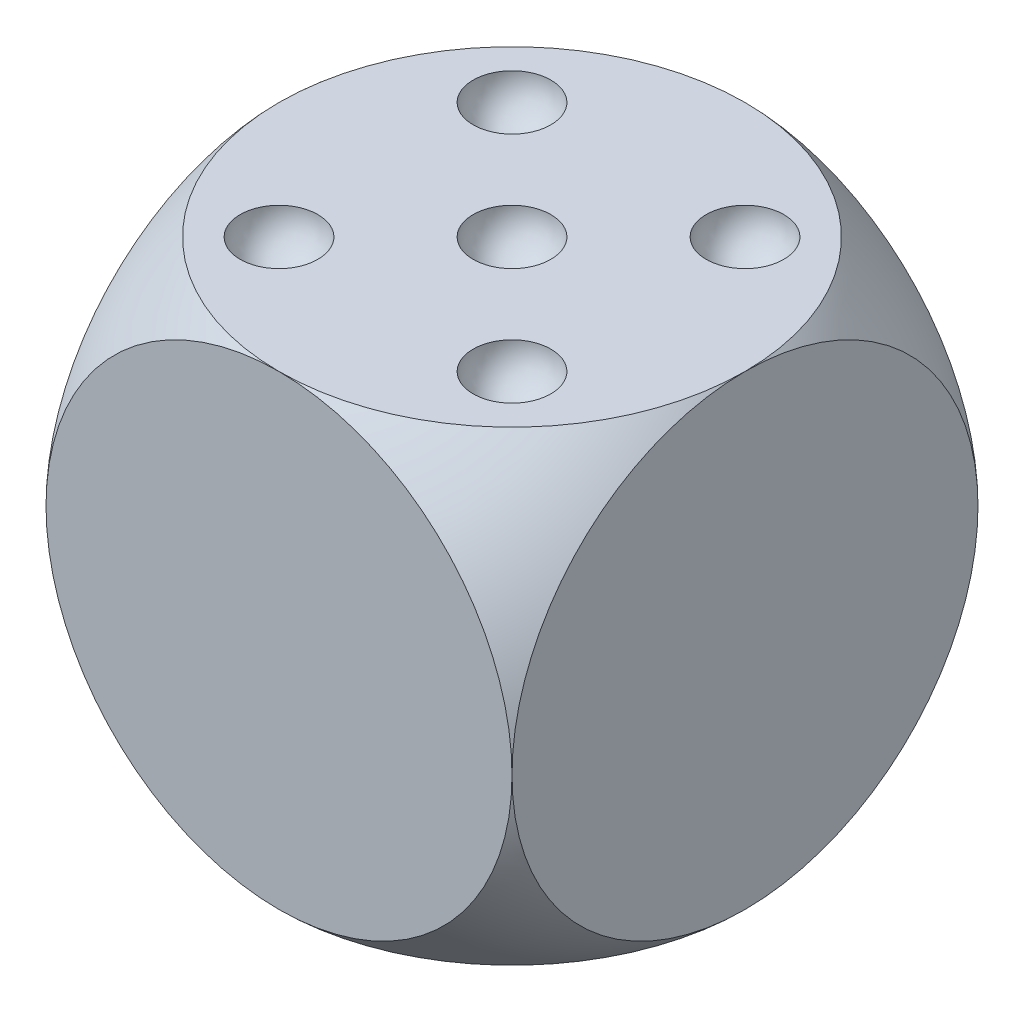
ISO-10303-21;
HEADER;
FILE_DESCRIPTION(('STEP AP214'),'2;1');
FILE_NAME('part.step','',(''),(''),'','','');
FILE_SCHEMA(('AUTOMOTIVE_DESIGN { 1 0 10303 214 1 1 1 1 }'));
ENDSEC;
DATA;
#1=APPLICATION_CONTEXT('core data for automotive mechanical design processes');
#2=APPLICATION_PROTOCOL_DEFINITION('international standard','automotive_design',2000,#1);
#3=PRODUCT_CONTEXT('',#1,'mechanical');
#4=PRODUCT('Part','Part','',(#3));
#5=PRODUCT_RELATED_PRODUCT_CATEGORY('part','',(#4));
#6=PRODUCT_DEFINITION_FORMATION('','',#4);
#7=PRODUCT_DEFINITION_CONTEXT('part definition',#1,'design');
#8=PRODUCT_DEFINITION('design','',#6,#7);
#9=PRODUCT_DEFINITION_SHAPE('','',#8);
#10=(LENGTH_UNIT() NAMED_UNIT(*) SI_UNIT(.MILLI.,.METRE.));
#11=(NAMED_UNIT(*) PLANE_ANGLE_UNIT() SI_UNIT($,.RADIAN.));
#12=(NAMED_UNIT(*) SI_UNIT($,.STERADIAN.) SOLID_ANGLE_UNIT());
#13=UNCERTAINTY_MEASURE_WITH_UNIT(LENGTH_MEASURE(1.E-05),#10,'distance_accuracy_value','');
#14=(GEOMETRIC_REPRESENTATION_CONTEXT(3) GLOBAL_UNCERTAINTY_ASSIGNED_CONTEXT((#13)) GLOBAL_UNIT_ASSIGNED_CONTEXT((#10,
#11,#12)) REPRESENTATION_CONTEXT('',''));
#15=CARTESIAN_POINT('',(0.,0.,0.));
#16=DIRECTION('',(0.,0.,1.));
#17=DIRECTION('',(1.,0.,0.));
#18=AXIS2_PLACEMENT_3D('',#15,#16,#17);
#19=CARTESIAN_POINT('',(0.,0.,30.));
#20=DIRECTION('',(0.,0.,1.));
#21=DIRECTION('',(1.,0.,0.));
#22=AXIS2_PLACEMENT_3D('',#19,#20,#21);
#23=PLANE('',#22);
#24=CARTESIAN_POINT('',(0.,0.,30.));
#25=DIRECTION('',(0.,0.,1.));
#26=DIRECTION('',(1.,0.,0.));
#27=AXIS2_PLACEMENT_3D('',#24,#25,#26);
#28=CIRCLE('',#27,30.);
#29=CARTESIAN_POINT('',(0.,-30.,30.));
#30=VERTEX_POINT('',#29);
#31=CARTESIAN_POINT('',(30.,0.,30.));
#32=VERTEX_POINT('',#31);
#33=EDGE_CURVE('E129',#30,#32,#28,.T.);
#34=ORIENTED_EDGE('',*,*,#33,.T.);
#35=CARTESIAN_POINT('',(0.,30.,30.));
#36=VERTEX_POINT('',#35);
#37=EDGE_CURVE('E74',#32,#36,#28,.T.);
#38=ORIENTED_EDGE('',*,*,#37,.T.);
#39=CARTESIAN_POINT('',(-30.,0.,30.));
#40=VERTEX_POINT('',#39);
#41=EDGE_CURVE('E119',#36,#40,#28,.T.);
#42=ORIENTED_EDGE('',*,*,#41,.T.);
#43=EDGE_CURVE('E125',#40,#30,#28,.T.);
#44=ORIENTED_EDGE('',*,*,#43,.T.);
#45=EDGE_LOOP('',(#34,#38,#42,#44));
#46=FACE_BOUND('',#45,.T.);
#47=ADVANCED_FACE('F48',(#46),#23,.T.);
#48=CARTESIAN_POINT('',(0.,0.,0.));
#49=DIRECTION('',(0.,0.,-1.));
#50=DIRECTION('',(-1.,0.,0.));
#51=AXIS2_PLACEMENT_3D('',#48,#49,#50);
#52=SPHERICAL_SURFACE('',#51,42.4264068711929);
#53=CARTESIAN_POINT('',(0.,-30.,0.));
#54=DIRECTION('',(0.,1.,0.));
#55=DIRECTION('',(0.,0.,1.));
#56=AXIS2_PLACEMENT_3D('',#53,#54,#55);
#57=CIRCLE('',#56,30.);
#58=CARTESIAN_POINT('',(30.,-30.,0.));
#59=VERTEX_POINT('',#58);
#60=EDGE_CURVE('E141',#30,#59,#57,.T.);
#61=ORIENTED_EDGE('',*,*,#60,.T.);
#62=CARTESIAN_POINT('',(30.,0.,0.));
#63=DIRECTION('',(-1.,0.,0.));
#64=DIRECTION('',(0.,-1.,0.));
#65=AXIS2_PLACEMENT_3D('',#62,#63,#64);
#66=CIRCLE('',#65,30.);
#67=EDGE_CURVE('E135',#59,#32,#66,.T.);
#68=ORIENTED_EDGE('',*,*,#67,.T.);
#69=ORIENTED_EDGE('',*,*,#33,.F.);
#70=EDGE_LOOP('',(#61,#68,#69));
#71=FACE_BOUND('',#70,.T.);
#72=ADVANCED_FACE('F190',(#71),#52,.T.);
#73=CARTESIAN_POINT('',(-30.,0.,0.));
#74=DIRECTION('',(1.,0.,0.));
#75=DIRECTION('',(0.,1.,0.));
#76=AXIS2_PLACEMENT_3D('',#73,#74,#75);
#77=CIRCLE('',#76,30.);
#78=CARTESIAN_POINT('',(-30.,-30.,0.));
#79=VERTEX_POINT('',#78);
#80=EDGE_CURVE('E339',#40,#79,#77,.T.);
#81=ORIENTED_EDGE('',*,*,#80,.T.);
#82=EDGE_CURVE('E138',#79,#30,#57,.T.);
#83=ORIENTED_EDGE('',*,*,#82,.T.);
#84=ORIENTED_EDGE('',*,*,#43,.F.);
#85=EDGE_LOOP('',(#81,#83,#84));
#86=FACE_BOUND('',#85,.T.);
#87=ADVANCED_FACE('F195',(#86),#52,.T.);
#88=CARTESIAN_POINT('',(-30.,30.,0.));
#89=VERTEX_POINT('',#88);
#90=EDGE_CURVE('E66',#89,#40,#77,.T.);
#91=ORIENTED_EDGE('',*,*,#90,.T.);
#92=ORIENTED_EDGE('',*,*,#41,.F.);
#93=CARTESIAN_POINT('',(0.,30.,0.));
#94=DIRECTION('',(0.,-1.,0.));
#95=DIRECTION('',(0.,0.,-1.));
#96=AXIS2_PLACEMENT_3D('',#93,#94,#95);
#97=CIRCLE('',#96,30.);
#98=EDGE_CURVE('E114',#36,#89,#97,.T.);
#99=ORIENTED_EDGE('',*,*,#98,.T.);
#100=EDGE_LOOP('',(#91,#92,#99));
#101=FACE_BOUND('',#100,.T.);
#102=ADVANCED_FACE('F120',(#101),#52,.T.);
#103=CARTESIAN_POINT('',(30.,30.,0.));
#104=VERTEX_POINT('',#103);
#105=EDGE_CURVE('E107',#32,#104,#66,.T.);
#106=ORIENTED_EDGE('',*,*,#105,.T.);
#107=EDGE_CURVE('E103',#104,#36,#97,.T.);
#108=ORIENTED_EDGE('',*,*,#107,.T.);
#109=ORIENTED_EDGE('',*,*,#37,.F.);
#110=EDGE_LOOP('',(#106,#108,#109));
#111=FACE_BOUND('',#110,.T.);
#112=ADVANCED_FACE('F105',(#111),#52,.T.);
#113=CARTESIAN_POINT('',(-30.,-30.,30.));
#114=DIRECTION('',(0.,1.,0.));
#115=DIRECTION('',(0.,0.,1.));
#116=AXIS2_PLACEMENT_3D('',#113,#114,#115);
#117=PLANE('',#116);
#118=ORIENTED_EDGE('',*,*,#60,.F.);
#119=ORIENTED_EDGE('',*,*,#82,.F.);
#120=CARTESIAN_POINT('',(0.,-30.,-30.));
#121=VERTEX_POINT('',#120);
#122=EDGE_CURVE('E140',#121,#79,#57,.T.);
#123=ORIENTED_EDGE('',*,*,#122,.F.);
#124=EDGE_CURVE('E348',#59,#121,#57,.T.);
#125=ORIENTED_EDGE('',*,*,#124,.F.);
#126=EDGE_LOOP('',(#118,#119,#123,#125));
#127=FACE_BOUND('',#126,.T.);
#128=ADVANCED_FACE('F200',(#127),#117,.F.);
#129=CARTESIAN_POINT('',(-30.,30.,30.));
#130=DIRECTION('',(1.,0.,0.));
#131=DIRECTION('',(0.,1.,0.));
#132=AXIS2_PLACEMENT_3D('',#129,#130,#131);
#133=PLANE('',#132);
#134=ORIENTED_EDGE('',*,*,#90,.F.);
#135=CARTESIAN_POINT('',(-30.,0.,-30.));
#136=VERTEX_POINT('',#135);
#137=EDGE_CURVE('E142',#136,#89,#77,.T.);
#138=ORIENTED_EDGE('',*,*,#137,.F.);
#139=EDGE_CURVE('E143',#79,#136,#77,.T.);
#140=ORIENTED_EDGE('',*,*,#139,.F.);
#141=ORIENTED_EDGE('',*,*,#80,.F.);
#142=EDGE_LOOP('',(#134,#138,#140,#141));
#143=FACE_BOUND('',#142,.T.);
#144=ADVANCED_FACE('F165',(#143),#133,.F.);
#145=CARTESIAN_POINT('',(-30.,30.,30.));
#146=DIRECTION('',(0.,-1.,0.));
#147=DIRECTION('',(0.,0.,-1.));
#148=AXIS2_PLACEMENT_3D('',#145,#146,#147);
#149=PLANE('',#148);
#150=CARTESIAN_POINT('',(15.,30.,-15.));
#151=DIRECTION('',(0.,-1.,0.));
#152=DIRECTION('',(0.,0.,-1.));
#153=AXIS2_PLACEMENT_3D('',#150,#151,#152);
#154=CIRCLE('',#153,5.);
#155=CARTESIAN_POINT('',(15.,30.,-20.));
#156=VERTEX_POINT('',#155);
#157=EDGE_CURVE('E52',#156,#156,#154,.F.);
#158=ORIENTED_EDGE('',*,*,#157,.F.);
#159=EDGE_LOOP('',(#158));
#160=FACE_BOUND('',#159,.T.);
#161=CARTESIAN_POINT('',(-15.,30.,-15.));
#162=DIRECTION('',(0.,-1.,0.));
#163=DIRECTION('',(0.,0.,-1.));
#164=AXIS2_PLACEMENT_3D('',#161,#162,#163);
#165=CIRCLE('',#164,5.);
#166=CARTESIAN_POINT('',(-15.,30.,-20.));
#167=VERTEX_POINT('',#166);
#168=EDGE_CURVE('E154',#167,#167,#165,.F.);
#169=ORIENTED_EDGE('',*,*,#168,.F.);
#170=EDGE_LOOP('',(#169));
#171=FACE_BOUND('',#170,.T.);
#172=CARTESIAN_POINT('',(0.,30.,0.));
#173=DIRECTION('',(0.,-1.,0.));
#174=DIRECTION('',(0.,0.,-1.));
#175=AXIS2_PLACEMENT_3D('',#172,#173,#174);
#176=CIRCLE('',#175,5.);
#177=CARTESIAN_POINT('',(0.,30.,-5.));
#178=VERTEX_POINT('',#177);
#179=EDGE_CURVE('E152',#178,#178,#176,.F.);
#180=ORIENTED_EDGE('',*,*,#179,.F.);
#181=EDGE_LOOP('',(#180));
#182=FACE_BOUND('',#181,.T.);
#183=CARTESIAN_POINT('',(15.,30.,15.));
#184=DIRECTION('',(0.,-1.,0.));
#185=DIRECTION('',(0.,0.,-1.));
#186=AXIS2_PLACEMENT_3D('',#183,#184,#185);
#187=CIRCLE('',#186,5.);
#188=CARTESIAN_POINT('',(15.,30.,10.));
#189=VERTEX_POINT('',#188);
#190=EDGE_CURVE('E149',#189,#189,#187,.F.);
#191=ORIENTED_EDGE('',*,*,#190,.F.);
#192=EDGE_LOOP('',(#191));
#193=FACE_BOUND('',#192,.T.);
#194=CARTESIAN_POINT('',(-15.,30.,15.));
#195=DIRECTION('',(0.,-1.,0.));
#196=DIRECTION('',(0.,0.,-1.));
#197=AXIS2_PLACEMENT_3D('',#194,#195,#196);
#198=CIRCLE('',#197,5.);
#199=CARTESIAN_POINT('',(-15.,30.,10.));
#200=VERTEX_POINT('',#199);
#201=EDGE_CURVE('E132',#200,#200,#198,.F.);
#202=ORIENTED_EDGE('',*,*,#201,.F.);
#203=EDGE_LOOP('',(#202));
#204=FACE_BOUND('',#203,.T.);
#205=CARTESIAN_POINT('',(0.,30.,-30.));
#206=VERTEX_POINT('',#205);
#207=EDGE_CURVE('E113',#206,#104,#97,.T.);
#208=ORIENTED_EDGE('',*,*,#207,.F.);
#209=EDGE_CURVE('E131',#89,#206,#97,.T.);
#210=ORIENTED_EDGE('',*,*,#209,.F.);
#211=ORIENTED_EDGE('',*,*,#98,.F.);
#212=ORIENTED_EDGE('',*,*,#107,.F.);
#213=EDGE_LOOP('',(#208,#210,#211,#212));
#214=FACE_BOUND('',#213,.T.);
#215=ADVANCED_FACE('F130',(#160,#171,#182,#193,#204,#214),#149,.F.);
#216=CARTESIAN_POINT('',(30.,30.,30.));
#217=DIRECTION('',(-1.,0.,0.));
#218=DIRECTION('',(0.,-1.,0.));
#219=AXIS2_PLACEMENT_3D('',#216,#217,#218);
#220=PLANE('',#219);
#221=ORIENTED_EDGE('',*,*,#67,.F.);
#222=CARTESIAN_POINT('',(30.,0.,-30.));
#223=VERTEX_POINT('',#222);
#224=EDGE_CURVE('E134',#223,#59,#66,.T.);
#225=ORIENTED_EDGE('',*,*,#224,.F.);
#226=EDGE_CURVE('E136',#104,#223,#66,.T.);
#227=ORIENTED_EDGE('',*,*,#226,.F.);
#228=ORIENTED_EDGE('',*,*,#105,.F.);
#229=EDGE_LOOP('',(#221,#225,#227,#228));
#230=FACE_BOUND('',#229,.T.);
#231=ADVANCED_FACE('F50',(#230),#220,.F.);
#232=ORIENTED_EDGE('',*,*,#124,.T.);
#233=CARTESIAN_POINT('',(0.,0.,-30.));
#234=DIRECTION('',(0.,0.,1.));
#235=DIRECTION('',(1.,0.,0.));
#236=AXIS2_PLACEMENT_3D('',#233,#234,#235);
#237=CIRCLE('',#236,30.);
#238=EDGE_CURVE('E59',#121,#223,#237,.T.);
#239=ORIENTED_EDGE('',*,*,#238,.T.);
#240=ORIENTED_EDGE('',*,*,#224,.T.);
#241=EDGE_LOOP('',(#232,#239,#240));
#242=FACE_BOUND('',#241,.T.);
#243=ADVANCED_FACE('F197',(#242),#52,.T.);
#244=ORIENTED_EDGE('',*,*,#139,.T.);
#245=EDGE_CURVE('E146',#136,#121,#237,.T.);
#246=ORIENTED_EDGE('',*,*,#245,.T.);
#247=ORIENTED_EDGE('',*,*,#122,.T.);
#248=EDGE_LOOP('',(#244,#246,#247));
#249=FACE_BOUND('',#248,.T.);
#250=ADVANCED_FACE('F227',(#249),#52,.T.);
#251=ORIENTED_EDGE('',*,*,#137,.T.);
#252=ORIENTED_EDGE('',*,*,#209,.T.);
#253=EDGE_CURVE('E57',#206,#136,#237,.T.);
#254=ORIENTED_EDGE('',*,*,#253,.T.);
#255=EDGE_LOOP('',(#251,#252,#254));
#256=FACE_BOUND('',#255,.T.);
#257=ADVANCED_FACE('F198',(#256),#52,.T.);
#258=ORIENTED_EDGE('',*,*,#226,.T.);
#259=EDGE_CURVE('E13',#223,#206,#237,.T.);
#260=ORIENTED_EDGE('',*,*,#259,.T.);
#261=ORIENTED_EDGE('',*,*,#207,.T.);
#262=EDGE_LOOP('',(#258,#260,#261));
#263=FACE_BOUND('',#262,.T.);
#264=ADVANCED_FACE('F185',(#263),#52,.T.);
#265=CARTESIAN_POINT('',(0.,0.,-30.));
#266=DIRECTION('',(0.,0.,1.));
#267=DIRECTION('',(1.,0.,0.));
#268=AXIS2_PLACEMENT_3D('',#265,#266,#267);
#269=PLANE('',#268);
#270=ORIENTED_EDGE('',*,*,#259,.F.);
#271=ORIENTED_EDGE('',*,*,#238,.F.);
#272=ORIENTED_EDGE('',*,*,#245,.F.);
#273=ORIENTED_EDGE('',*,*,#253,.F.);
#274=EDGE_LOOP('',(#270,#271,#272,#273));
#275=FACE_BOUND('',#274,.T.);
#276=ADVANCED_FACE('F176',(#275),#269,.F.);
#277=CARTESIAN_POINT('',(-15.,30.,15.));
#278=DIRECTION('',(0.,0.,-1.));
#279=DIRECTION('',(1.,0.,0.));
#280=AXIS2_PLACEMENT_3D('',#277,#278,#279);
#281=SPHERICAL_SURFACE('',#280,5.);
#282=CARTESIAN_POINT('',(-15.,30.,15.));
#283=DIRECTION('',(0.,-1.,0.));
#284=DIRECTION('',(0.,0.,-1.));
#285=AXIS2_PLACEMENT_3D('',#282,#283,#284);
#286=SPHERICAL_SURFACE('',#285,5.);
#287=ORIENTED_EDGE('',*,*,#201,.T.);
#288=EDGE_LOOP('',(#287));
#289=FACE_BOUND('',#288,.T.);
#290=ADVANCED_FACE('F173',(#289),#286,.F.);
#291=CARTESIAN_POINT('',(15.,30.,15.));
#292=DIRECTION('',(0.,0.,-1.));
#293=DIRECTION('',(1.,0.,0.));
#294=AXIS2_PLACEMENT_3D('',#291,#292,#293);
#295=SPHERICAL_SURFACE('',#294,5.);
#296=CARTESIAN_POINT('',(15.,30.,15.));
#297=DIRECTION('',(0.,-1.,0.));
#298=DIRECTION('',(0.,0.,-1.));
#299=AXIS2_PLACEMENT_3D('',#296,#297,#298);
#300=SPHERICAL_SURFACE('',#299,5.);
#301=ORIENTED_EDGE('',*,*,#190,.T.);
#302=EDGE_LOOP('',(#301));
#303=FACE_BOUND('',#302,.T.);
#304=ADVANCED_FACE('F175',(#303),#300,.F.);
#305=CARTESIAN_POINT('',(0.,30.,0.));
#306=DIRECTION('',(0.,0.,-1.));
#307=DIRECTION('',(1.,0.,0.));
#308=AXIS2_PLACEMENT_3D('',#305,#306,#307);
#309=SPHERICAL_SURFACE('',#308,5.);
#310=CARTESIAN_POINT('',(0.,30.,0.));
#311=DIRECTION('',(0.,-1.,0.));
#312=DIRECTION('',(0.,0.,-1.));
#313=AXIS2_PLACEMENT_3D('',#310,#311,#312);
#314=SPHERICAL_SURFACE('',#313,5.);
#315=ORIENTED_EDGE('',*,*,#179,.T.);
#316=EDGE_LOOP('',(#315));
#317=FACE_BOUND('',#316,.T.);
#318=ADVANCED_FACE('F182',(#317),#314,.F.);
#319=CARTESIAN_POINT('',(-15.,30.,-15.));
#320=DIRECTION('',(0.,0.,-1.));
#321=DIRECTION('',(1.,0.,0.));
#322=AXIS2_PLACEMENT_3D('',#319,#320,#321);
#323=SPHERICAL_SURFACE('',#322,5.);
#324=CARTESIAN_POINT('',(-15.,30.,-15.));
#325=DIRECTION('',(0.,-1.,0.));
#326=DIRECTION('',(0.,0.,-1.));
#327=AXIS2_PLACEMENT_3D('',#324,#325,#326);
#328=SPHERICAL_SURFACE('',#327,5.);
#329=ORIENTED_EDGE('',*,*,#168,.T.);
#330=EDGE_LOOP('',(#329));
#331=FACE_BOUND('',#330,.T.);
#332=ADVANCED_FACE('F271',(#331),#328,.F.);
#333=CARTESIAN_POINT('',(15.,30.,-15.));
#334=DIRECTION('',(0.,0.,-1.));
#335=DIRECTION('',(1.,0.,0.));
#336=AXIS2_PLACEMENT_3D('',#333,#334,#335);
#337=SPHERICAL_SURFACE('',#336,5.);
#338=CARTESIAN_POINT('',(15.,30.,-15.));
#339=DIRECTION('',(0.,-1.,0.));
#340=DIRECTION('',(0.,0.,-1.));
#341=AXIS2_PLACEMENT_3D('',#338,#339,#340);
#342=SPHERICAL_SURFACE('',#341,5.);
#343=ORIENTED_EDGE('',*,*,#157,.T.);
#344=EDGE_LOOP('',(#343));
#345=FACE_BOUND('',#344,.T.);
#346=ADVANCED_FACE('F161',(#345),#342,.F.);
#347=CLOSED_SHELL('',(#47,#72,#87,#102,#112,#128,#144,#215,#231,#243,#250,#257,#264,#276,#290,
#304,#318,#332,#346));
#348=MANIFOLD_SOLID_BREP('B2',#347);
#349=ADVANCED_BREP_SHAPE_REPRESENTATION('',(#18,#348),#14);
#350=SHAPE_DEFINITION_REPRESENTATION(#9,#349);
ENDSEC;
END-ISO-10303-21;
